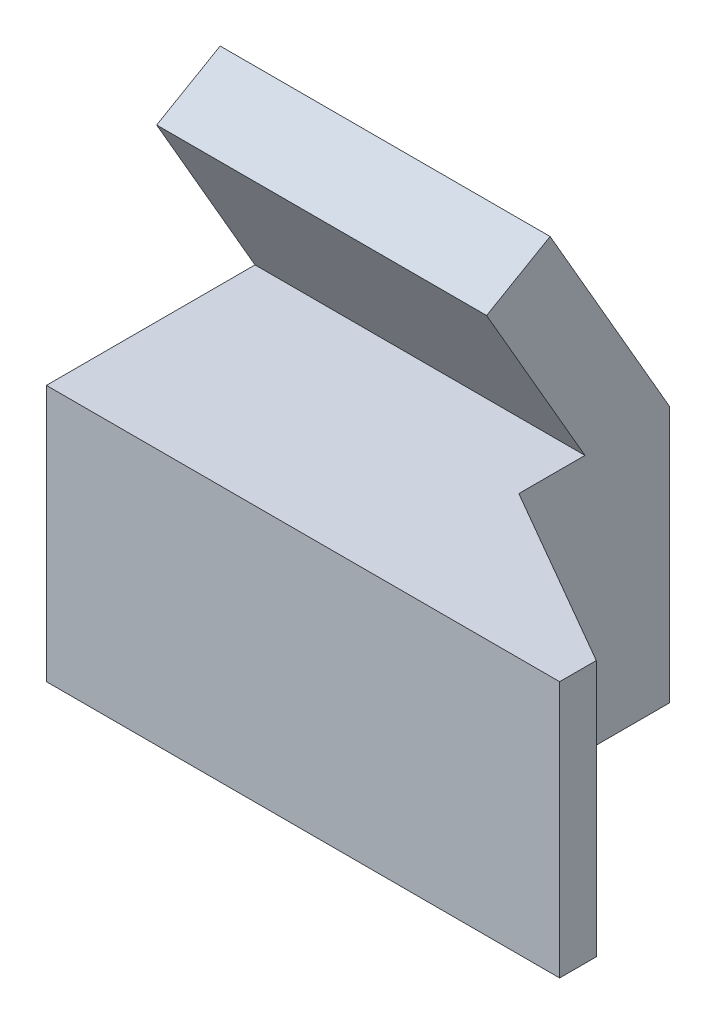
ISO-10303-21;
HEADER;
FILE_DESCRIPTION(('STEP AP214'),'2;1');
FILE_NAME('part.step','',(''),(''),'','','');
FILE_SCHEMA(('AUTOMOTIVE_DESIGN { 1 0 10303 214 1 1 1 1 }'));
ENDSEC;
DATA;
#1=APPLICATION_CONTEXT('core data for automotive mechanical design processes');
#2=APPLICATION_PROTOCOL_DEFINITION('international standard','automotive_design',2000,#1);
#3=PRODUCT_CONTEXT('',#1,'mechanical');
#4=PRODUCT('Part','Part','',(#3));
#5=PRODUCT_RELATED_PRODUCT_CATEGORY('part','',(#4));
#6=PRODUCT_DEFINITION_FORMATION('','',#4);
#7=PRODUCT_DEFINITION_CONTEXT('part definition',#1,'design');
#8=PRODUCT_DEFINITION('design','',#6,#7);
#9=PRODUCT_DEFINITION_SHAPE('','',#8);
#10=(LENGTH_UNIT() NAMED_UNIT(*) SI_UNIT(.MILLI.,.METRE.));
#11=(NAMED_UNIT(*) PLANE_ANGLE_UNIT() SI_UNIT($,.RADIAN.));
#12=(NAMED_UNIT(*) SI_UNIT($,.STERADIAN.) SOLID_ANGLE_UNIT());
#13=UNCERTAINTY_MEASURE_WITH_UNIT(LENGTH_MEASURE(1.E-05),#10,'distance_accuracy_value','');
#14=(GEOMETRIC_REPRESENTATION_CONTEXT(3) GLOBAL_UNCERTAINTY_ASSIGNED_CONTEXT((#13)) GLOBAL_UNIT_ASSIGNED_CONTEXT((#10,
#11,#12)) REPRESENTATION_CONTEXT('',''));
#15=CARTESIAN_POINT('',(0.,0.,0.));
#16=DIRECTION('',(0.,0.,1.));
#17=DIRECTION('',(1.,0.,0.));
#18=AXIS2_PLACEMENT_3D('',#15,#16,#17);
#19=CARTESIAN_POINT('',(0.,44.45,0.));
#20=DIRECTION('',(1.,0.,0.));
#21=DIRECTION('',(0.,0.,-1.));
#22=AXIS2_PLACEMENT_3D('',#19,#20,#21);
#23=PLANE('',#22);
#24=DIRECTION('',(0.,0.,1.));
#25=VECTOR('',#24,1.);
#26=CARTESIAN_POINT('',(0.,0.,0.));
#27=LINE('',#26,#25);
#28=CARTESIAN_POINT('',(0.,0.,-50.8));
#29=VERTEX_POINT('',#28);
#30=CARTESIAN_POINT('',(0.,0.,0.));
#31=VERTEX_POINT('',#30);
#32=EDGE_CURVE('E138',#29,#31,#27,.T.);
#33=ORIENTED_EDGE('',*,*,#32,.T.);
#34=DIRECTION('',(0.,-1.,0.));
#35=VECTOR('',#34,1.);
#36=CARTESIAN_POINT('',(0.,44.45,0.));
#37=LINE('',#36,#35);
#38=CARTESIAN_POINT('',(0.,44.45,0.));
#39=VERTEX_POINT('',#38);
#40=EDGE_CURVE('E11',#39,#31,#37,.T.);
#41=ORIENTED_EDGE('',*,*,#40,.F.);
#42=DIRECTION('',(0.,0.,1.));
#43=VECTOR('',#42,1.);
#44=CARTESIAN_POINT('',(0.,44.45,0.));
#45=LINE('',#44,#43);
#46=CARTESIAN_POINT('',(0.,44.45,-36.1353031625836));
#47=VERTEX_POINT('',#46);
#48=EDGE_CURVE('E95',#47,#39,#45,.T.);
#49=ORIENTED_EDGE('',*,*,#48,.F.);
#50=DIRECTION('',(0.,0.866025403784442,0.499999999999995));
#51=VECTOR('',#50,1.);
#52=CARTESIAN_POINT('',(0.,73.9551837674835,-19.1004773719378));
#53=LINE('',#52,#51);
#54=CARTESIAN_POINT('',(0.,73.9551837674835,-19.1004773719378));
#55=VERTEX_POINT('',#54);
#56=EDGE_CURVE('E194',#47,#55,#53,.T.);
#57=ORIENTED_EDGE('',*,*,#56,.T.);
#58=DIRECTION('',(0.,0.499999999999993,-0.866025403784443));
#59=VECTOR('',#58,1.);
#60=CARTESIAN_POINT('',(0.,80.3051837674834,-30.0990000000002));
#61=LINE('',#60,#59);
#62=CARTESIAN_POINT('',(0.,80.3051837674834,-30.0990000000002));
#63=VERTEX_POINT('',#62);
#64=EDGE_CURVE('E198',#55,#63,#61,.T.);
#65=ORIENTED_EDGE('',*,*,#64,.T.);
#66=DIRECTION('',(0.,-0.866025403784442,-0.499999999999995));
#67=VECTOR('',#66,1.);
#68=CARTESIAN_POINT('',(0.,44.45,-50.8));
#69=LINE('',#68,#67);
#70=CARTESIAN_POINT('',(0.,44.45,-50.8));
#71=VERTEX_POINT('',#70);
#72=EDGE_CURVE('E203',#63,#71,#69,.T.);
#73=ORIENTED_EDGE('',*,*,#72,.T.);
#74=DIRECTION('',(0.,-1.,0.));
#75=VECTOR('',#74,1.);
#76=CARTESIAN_POINT('',(0.,44.45,-50.8));
#77=LINE('',#76,#75);
#78=EDGE_CURVE('E63',#71,#29,#77,.T.);
#79=ORIENTED_EDGE('',*,*,#78,.T.);
#80=EDGE_LOOP('',(#33,#41,#49,#57,#65,#73,#79));
#81=FACE_BOUND('',#80,.T.);
#82=ADVANCED_FACE('F39',(#81),#23,.F.);
#83=CARTESIAN_POINT('',(57.15,44.45,0.));
#84=DIRECTION('',(0.,0.,-1.));
#85=DIRECTION('',(-1.,0.,0.));
#86=AXIS2_PLACEMENT_3D('',#83,#84,#85);
#87=PLANE('',#86);
#88=DIRECTION('',(1.,0.,0.));
#89=VECTOR('',#88,1.);
#90=CARTESIAN_POINT('',(57.15,0.,0.));
#91=LINE('',#90,#89);
#92=CARTESIAN_POINT('',(88.9,0.,0.));
#93=VERTEX_POINT('',#92);
#94=EDGE_CURVE('E142',#31,#93,#91,.T.);
#95=ORIENTED_EDGE('',*,*,#94,.T.);
#96=DIRECTION('',(0.,-1.,0.));
#97=VECTOR('',#96,1.);
#98=CARTESIAN_POINT('',(88.9,44.45,0.));
#99=LINE('',#98,#97);
#100=CARTESIAN_POINT('',(88.9,44.45,0.));
#101=VERTEX_POINT('',#100);
#102=EDGE_CURVE('E47',#101,#93,#99,.T.);
#103=ORIENTED_EDGE('',*,*,#102,.F.);
#104=DIRECTION('',(1.,0.,0.));
#105=VECTOR('',#104,1.);
#106=CARTESIAN_POINT('',(0.,44.45,0.));
#107=LINE('',#106,#105);
#108=EDGE_CURVE('E220',#39,#101,#107,.T.);
#109=ORIENTED_EDGE('',*,*,#108,.F.);
#110=ORIENTED_EDGE('',*,*,#40,.T.);
#111=EDGE_LOOP('',(#95,#103,#109,#110));
#112=FACE_BOUND('',#111,.T.);
#113=ADVANCED_FACE('F224',(#112),#87,.F.);
#114=CARTESIAN_POINT('',(88.9,44.45,0.));
#115=DIRECTION('',(-1.,0.,0.));
#116=DIRECTION('',(0.,0.,1.));
#117=AXIS2_PLACEMENT_3D('',#114,#115,#116);
#118=PLANE('',#117);
#119=DIRECTION('',(0.,0.,-1.));
#120=VECTOR('',#119,1.);
#121=CARTESIAN_POINT('',(88.9,0.,0.));
#122=LINE('',#121,#120);
#123=CARTESIAN_POINT('',(88.9,0.,-6.35));
#124=VERTEX_POINT('',#123);
#125=EDGE_CURVE('E146',#93,#124,#122,.T.);
#126=ORIENTED_EDGE('',*,*,#125,.T.);
#127=DIRECTION('',(0.,-1.,0.));
#128=VECTOR('',#127,1.);
#129=CARTESIAN_POINT('',(88.9,44.45,-6.35));
#130=LINE('',#129,#128);
#131=CARTESIAN_POINT('',(88.9,44.45,-6.35));
#132=VERTEX_POINT('',#131);
#133=EDGE_CURVE('E123',#132,#124,#130,.T.);
#134=ORIENTED_EDGE('',*,*,#133,.F.);
#135=DIRECTION('',(0.,0.,-1.));
#136=VECTOR('',#135,1.);
#137=CARTESIAN_POINT('',(88.9,44.45,0.));
#138=LINE('',#137,#136);
#139=EDGE_CURVE('E109',#101,#132,#138,.T.);
#140=ORIENTED_EDGE('',*,*,#139,.F.);
#141=ORIENTED_EDGE('',*,*,#102,.T.);
#142=EDGE_LOOP('',(#126,#134,#140,#141));
#143=FACE_BOUND('',#142,.T.);
#144=ADVANCED_FACE('F166',(#143),#118,.F.);
#145=CARTESIAN_POINT('',(88.9,44.45,-6.35));
#146=DIRECTION('',(-0.499999999999998,0.,0.86602540378444));
#147=DIRECTION('',(0.86602540378444,0.,0.499999999999998));
#148=AXIS2_PLACEMENT_3D('',#145,#146,#147);
#149=PLANE('',#148);
#150=CARTESIAN_POINT('',(72.4022160579064,22.352,-15.875));
#151=DIRECTION('',(0.499999999999998,0.,-0.86602540378444));
#152=DIRECTION('',(-0.86602540378444,0.,-0.499999999999998));
#153=AXIS2_PLACEMENT_3D('',#150,#151,#152);
#154=CIRCLE('',#153,9.525);
#155=CARTESIAN_POINT('',(64.1533240868596,22.352,-20.6374999999999));
#156=VERTEX_POINT('',#155);
#157=EDGE_CURVE('E208',#156,#156,#154,.T.);
#158=ORIENTED_EDGE('',*,*,#157,.F.);
#159=EDGE_LOOP('',(#158));
#160=FACE_BOUND('',#159,.T.);
#161=DIRECTION('',(-0.86602540378444,0.,-0.499999999999998));
#162=VECTOR('',#161,1.);
#163=CARTESIAN_POINT('',(88.9,0.,-6.35));
#164=LINE('',#163,#162);
#165=CARTESIAN_POINT('',(57.15,0.,-24.6808710467705));
#166=VERTEX_POINT('',#165);
#167=EDGE_CURVE('E119',#124,#166,#164,.T.);
#168=ORIENTED_EDGE('',*,*,#167,.T.);
#169=DIRECTION('',(0.,-1.,0.));
#170=VECTOR('',#169,1.);
#171=CARTESIAN_POINT('',(57.15,44.45,-24.6808710467705));
#172=LINE('',#171,#170);
#173=CARTESIAN_POINT('',(57.15,44.45,-24.6808710467705));
#174=VERTEX_POINT('',#173);
#175=EDGE_CURVE('E116',#174,#166,#172,.T.);
#176=ORIENTED_EDGE('',*,*,#175,.F.);
#177=DIRECTION('',(-0.86602540378444,0.,-0.499999999999998));
#178=VECTOR('',#177,1.);
#179=CARTESIAN_POINT('',(88.9,44.45,-6.35));
#180=LINE('',#179,#178);
#181=EDGE_CURVE('E105',#132,#174,#180,.T.);
#182=ORIENTED_EDGE('',*,*,#181,.F.);
#183=ORIENTED_EDGE('',*,*,#133,.T.);
#184=EDGE_LOOP('',(#168,#176,#182,#183));
#185=FACE_BOUND('',#184,.T.);
#186=ADVANCED_FACE('F117',(#160,#185),#149,.F.);
#187=CARTESIAN_POINT('',(57.15,44.45,-24.6808710467705));
#188=DIRECTION('',(-1.,0.,0.));
#189=DIRECTION('',(0.,0.,1.));
#190=AXIS2_PLACEMENT_3D('',#187,#188,#189);
#191=PLANE('',#190);
#192=DIRECTION('',(0.,0.,-1.));
#193=VECTOR('',#192,1.);
#194=CARTESIAN_POINT('',(57.15,0.,-24.6808710467705));
#195=LINE('',#194,#193);
#196=CARTESIAN_POINT('',(57.15,0.,-50.8));
#197=VERTEX_POINT('',#196);
#198=EDGE_CURVE('E151',#166,#197,#195,.T.);
#199=ORIENTED_EDGE('',*,*,#198,.T.);
#200=DIRECTION('',(0.,-1.,0.));
#201=VECTOR('',#200,1.);
#202=CARTESIAN_POINT('',(57.15,44.45,-50.8));
#203=LINE('',#202,#201);
#204=CARTESIAN_POINT('',(57.15,44.45,-50.8));
#205=VERTEX_POINT('',#204);
#206=EDGE_CURVE('E124',#205,#197,#203,.T.);
#207=ORIENTED_EDGE('',*,*,#206,.F.);
#208=DIRECTION('',(0.,-0.866025403784442,-0.499999999999995));
#209=VECTOR('',#208,1.);
#210=CARTESIAN_POINT('',(57.15,44.45,-50.8));
#211=LINE('',#210,#209);
#212=CARTESIAN_POINT('',(57.15,80.3051837674834,-30.0990000000002));
#213=VERTEX_POINT('',#212);
#214=EDGE_CURVE('E178',#213,#205,#211,.T.);
#215=ORIENTED_EDGE('',*,*,#214,.F.);
#216=DIRECTION('',(0.,0.499999999999993,-0.866025403784443));
#217=VECTOR('',#216,1.);
#218=CARTESIAN_POINT('',(57.15,80.3051837674834,-30.0990000000002));
#219=LINE('',#218,#217);
#220=CARTESIAN_POINT('',(57.15,73.9551837674835,-19.1004773719378));
#221=VERTEX_POINT('',#220);
#222=EDGE_CURVE('E185',#221,#213,#219,.T.);
#223=ORIENTED_EDGE('',*,*,#222,.F.);
#224=DIRECTION('',(0.,0.866025403784442,0.499999999999995));
#225=VECTOR('',#224,1.);
#226=CARTESIAN_POINT('',(57.15,73.9551837674835,-19.1004773719378));
#227=LINE('',#226,#225);
#228=CARTESIAN_POINT('',(57.15,44.45,-36.1353031625836));
#229=VERTEX_POINT('',#228);
#230=EDGE_CURVE('E130',#229,#221,#227,.T.);
#231=ORIENTED_EDGE('',*,*,#230,.F.);
#232=DIRECTION('',(0.,0.,-1.));
#233=VECTOR('',#232,1.);
#234=CARTESIAN_POINT('',(57.15,44.45,-24.6808710467705));
#235=LINE('',#234,#233);
#236=EDGE_CURVE('E54',#174,#229,#235,.T.);
#237=ORIENTED_EDGE('',*,*,#236,.F.);
#238=ORIENTED_EDGE('',*,*,#175,.T.);
#239=EDGE_LOOP('',(#199,#207,#215,#223,#231,#237,#238));
#240=FACE_BOUND('',#239,.T.);
#241=ADVANCED_FACE('F127',(#240),#191,.F.);
#242=CARTESIAN_POINT('',(0.,44.45,-50.8));
#243=DIRECTION('',(0.,0.,1.));
#244=DIRECTION('',(1.,0.,0.));
#245=AXIS2_PLACEMENT_3D('',#242,#243,#244);
#246=PLANE('',#245);
#247=CARTESIAN_POINT('',(41.1479999999998,12.7,-50.8));
#248=DIRECTION('',(0.,0.,-1.));
#249=DIRECTION('',(-1.,0.,0.));
#250=AXIS2_PLACEMENT_3D('',#247,#248,#249);
#251=CIRCLE('',#250,4.7625);
#252=CARTESIAN_POINT('',(36.3854999999998,12.7,-50.8));
#253=VERTEX_POINT('',#252);
#254=EDGE_CURVE('E409',#253,#253,#251,.T.);
#255=ORIENTED_EDGE('',*,*,#254,.F.);
#256=EDGE_LOOP('',(#255));
#257=FACE_BOUND('',#256,.T.);
#258=CARTESIAN_POINT('',(16.002,12.7,-50.8));
#259=DIRECTION('',(0.,0.,-1.));
#260=DIRECTION('',(-1.,0.,0.));
#261=AXIS2_PLACEMENT_3D('',#258,#259,#260);
#262=CIRCLE('',#261,4.7625000000002);
#263=CARTESIAN_POINT('',(11.2394999999998,12.7,-50.8));
#264=VERTEX_POINT('',#263);
#265=EDGE_CURVE('E408',#264,#264,#262,.T.);
#266=ORIENTED_EDGE('',*,*,#265,.F.);
#267=EDGE_LOOP('',(#266));
#268=FACE_BOUND('',#267,.T.);
#269=CARTESIAN_POINT('',(16.002,31.75,-50.8));
#270=DIRECTION('',(0.,0.,-1.));
#271=DIRECTION('',(-1.,0.,0.));
#272=AXIS2_PLACEMENT_3D('',#269,#270,#271);
#273=CIRCLE('',#272,4.7625);
#274=CARTESIAN_POINT('',(11.2395,31.75,-50.8));
#275=VERTEX_POINT('',#274);
#276=EDGE_CURVE('E439',#275,#275,#273,.T.);
#277=ORIENTED_EDGE('',*,*,#276,.F.);
#278=EDGE_LOOP('',(#277));
#279=FACE_BOUND('',#278,.T.);
#280=CARTESIAN_POINT('',(41.148,31.75,-50.8));
#281=DIRECTION('',(0.,0.,-1.));
#282=DIRECTION('',(-1.,0.,0.));
#283=AXIS2_PLACEMENT_3D('',#280,#281,#282);
#284=CIRCLE('',#283,4.7625);
#285=CARTESIAN_POINT('',(36.3855,31.75,-50.8));
#286=VERTEX_POINT('',#285);
#287=EDGE_CURVE('E425',#286,#286,#284,.T.);
#288=ORIENTED_EDGE('',*,*,#287,.F.);
#289=EDGE_LOOP('',(#288));
#290=FACE_BOUND('',#289,.T.);
#291=DIRECTION('',(-1.,0.,0.));
#292=VECTOR('',#291,1.);
#293=CARTESIAN_POINT('',(0.,0.,-50.8));
#294=LINE('',#293,#292);
#295=EDGE_CURVE('E89',#197,#29,#294,.T.);
#296=ORIENTED_EDGE('',*,*,#295,.T.);
#297=ORIENTED_EDGE('',*,*,#78,.F.);
#298=DIRECTION('',(-1.,0.,0.));
#299=VECTOR('',#298,1.);
#300=CARTESIAN_POINT('',(0.,44.45,-50.8));
#301=LINE('',#300,#299);
#302=EDGE_CURVE('E132',#205,#71,#301,.T.);
#303=ORIENTED_EDGE('',*,*,#302,.F.);
#304=ORIENTED_EDGE('',*,*,#206,.T.);
#305=EDGE_LOOP('',(#296,#297,#303,#304));
#306=FACE_BOUND('',#305,.T.);
#307=ADVANCED_FACE('F172',(#257,#268,#279,#290,#306),#246,.F.);
#308=CARTESIAN_POINT('',(0.,44.45,0.));
#309=DIRECTION('',(0.,-1.,0.));
#310=DIRECTION('',(0.,0.,-1.));
#311=AXIS2_PLACEMENT_3D('',#308,#309,#310);
#312=PLANE('',#311);
#313=ORIENTED_EDGE('',*,*,#236,.T.);
#314=DIRECTION('',(-1.,0.,0.));
#315=VECTOR('',#314,1.);
#316=CARTESIAN_POINT('',(57.15,44.45,-36.1353031625836));
#317=LINE('',#316,#315);
#318=EDGE_CURVE('E184',#229,#47,#317,.T.);
#319=ORIENTED_EDGE('',*,*,#318,.T.);
#320=ORIENTED_EDGE('',*,*,#48,.T.);
#321=ORIENTED_EDGE('',*,*,#108,.T.);
#322=ORIENTED_EDGE('',*,*,#139,.T.);
#323=ORIENTED_EDGE('',*,*,#181,.T.);
#324=EDGE_LOOP('',(#313,#319,#320,#321,#322,#323));
#325=FACE_BOUND('',#324,.T.);
#326=ADVANCED_FACE('F107',(#325),#312,.F.);
#327=CARTESIAN_POINT('',(0.,0.,0.));
#328=DIRECTION('',(0.,-1.,0.));
#329=DIRECTION('',(0.,0.,-1.));
#330=AXIS2_PLACEMENT_3D('',#327,#328,#329);
#331=PLANE('',#330);
#332=ORIENTED_EDGE('',*,*,#198,.F.);
#333=ORIENTED_EDGE('',*,*,#167,.F.);
#334=ORIENTED_EDGE('',*,*,#125,.F.);
#335=ORIENTED_EDGE('',*,*,#94,.F.);
#336=ORIENTED_EDGE('',*,*,#32,.F.);
#337=ORIENTED_EDGE('',*,*,#295,.F.);
#338=EDGE_LOOP('',(#332,#333,#334,#335,#336,#337));
#339=FACE_BOUND('',#338,.T.);
#340=ADVANCED_FACE('F169',(#339),#331,.T.);
#341=CARTESIAN_POINT('',(69.2272160579064,22.352,-10.3757386859688));
#342=DIRECTION('',(0.499999999999998,0.,-0.86602540378444));
#343=DIRECTION('',(-0.86602540378444,0.,-0.499999999999998));
#344=AXIS2_PLACEMENT_3D('',#341,#342,#343);
#345=CYLINDRICAL_SURFACE('',#344,9.525);
#346=CARTESIAN_POINT('',(69.2272160579064,22.352,-10.3757386859688));
#347=DIRECTION('',(0.499999999999998,0.,-0.86602540378444));
#348=DIRECTION('',(-0.86602540378444,0.,-0.499999999999998));
#349=AXIS2_PLACEMENT_3D('',#346,#347,#348);
#350=CIRCLE('',#349,9.525);
#351=CARTESIAN_POINT('',(60.9783240868597,22.352,-15.1382386859688));
#352=VERTEX_POINT('',#351);
#353=EDGE_CURVE('E143',#352,#352,#350,.T.);
#354=ORIENTED_EDGE('',*,*,#353,.F.);
#355=EDGE_LOOP('',(#354));
#356=FACE_BOUND('',#355,.T.);
#357=ORIENTED_EDGE('',*,*,#157,.T.);
#358=EDGE_LOOP('',(#357));
#359=FACE_BOUND('',#358,.T.);
#360=ADVANCED_FACE('F269',(#356,#359),#345,.F.);
#361=CARTESIAN_POINT('',(69.2272160579064,22.352,-10.3757386859688));
#362=DIRECTION('',(0.499999999999998,0.,-0.86602540378444));
#363=DIRECTION('',(-0.86602540378444,0.,-0.499999999999998));
#364=AXIS2_PLACEMENT_3D('',#361,#362,#363);
#365=PLANE('',#364);
#366=ORIENTED_EDGE('',*,*,#353,.T.);
#367=EDGE_LOOP('',(#366));
#368=FACE_BOUND('',#367,.T.);
#369=ADVANCED_FACE('F247',(#368),#365,.T.);
#370=CARTESIAN_POINT('',(57.15,44.45,-50.8));
#371=DIRECTION('',(0.,0.499999999999995,-0.866025403784442));
#372=DIRECTION('',(0.,0.866025403784442,0.499999999999995));
#373=AXIS2_PLACEMENT_3D('',#370,#371,#372);
#374=PLANE('',#373);
#375=CARTESIAN_POINT('',(28.702,63.8073998253899,-39.6240000000001));
#376=DIRECTION('',(0.,0.499999999999995,-0.866025403784442));
#377=DIRECTION('',(0.,0.866025403784442,0.499999999999995));
#378=AXIS2_PLACEMENT_3D('',#375,#376,#377);
#379=CIRCLE('',#378,9.525);
#380=CARTESIAN_POINT('',(28.702,72.0562917964367,-34.8615000000002));
#381=VERTEX_POINT('',#380);
#382=EDGE_CURVE('E424',#381,#381,#379,.T.);
#383=ORIENTED_EDGE('',*,*,#382,.F.);
#384=EDGE_LOOP('',(#383));
#385=FACE_BOUND('',#384,.T.);
#386=ORIENTED_EDGE('',*,*,#72,.F.);
#387=DIRECTION('',(-1.,0.,0.));
#388=VECTOR('',#387,1.);
#389=CARTESIAN_POINT('',(57.15,80.3051837674834,-30.0990000000002));
#390=LINE('',#389,#388);
#391=EDGE_CURVE('E181',#213,#63,#390,.T.);
#392=ORIENTED_EDGE('',*,*,#391,.F.);
#393=ORIENTED_EDGE('',*,*,#214,.T.);
#394=ORIENTED_EDGE('',*,*,#302,.T.);
#395=EDGE_LOOP('',(#386,#392,#393,#394));
#396=FACE_BOUND('',#395,.T.);
#397=ADVANCED_FACE('F179',(#385,#396),#374,.T.);
#398=CARTESIAN_POINT('',(57.15,80.3051837674834,-30.0990000000002));
#399=DIRECTION('',(0.,0.866025403784443,0.499999999999993));
#400=DIRECTION('',(0.,-0.499999999999993,0.866025403784443));
#401=AXIS2_PLACEMENT_3D('',#398,#399,#400);
#402=PLANE('',#401);
#403=ORIENTED_EDGE('',*,*,#64,.F.);
#404=DIRECTION('',(-1.,0.,0.));
#405=VECTOR('',#404,1.);
#406=CARTESIAN_POINT('',(57.15,73.9551837674835,-19.1004773719378));
#407=LINE('',#406,#405);
#408=EDGE_CURVE('E189',#221,#55,#407,.T.);
#409=ORIENTED_EDGE('',*,*,#408,.F.);
#410=ORIENTED_EDGE('',*,*,#222,.T.);
#411=ORIENTED_EDGE('',*,*,#391,.T.);
#412=EDGE_LOOP('',(#403,#409,#410,#411));
#413=FACE_BOUND('',#412,.T.);
#414=ADVANCED_FACE('F238',(#413),#402,.T.);
#415=CARTESIAN_POINT('',(57.15,73.9551837674835,-19.1004773719378));
#416=DIRECTION('',(0.,-0.499999999999995,0.866025403784442));
#417=DIRECTION('',(0.,-0.866025403784442,-0.499999999999995));
#418=AXIS2_PLACEMENT_3D('',#415,#416,#417);
#419=PLANE('',#418);
#420=ORIENTED_EDGE('',*,*,#56,.F.);
#421=ORIENTED_EDGE('',*,*,#318,.F.);
#422=ORIENTED_EDGE('',*,*,#230,.T.);
#423=ORIENTED_EDGE('',*,*,#408,.T.);
#424=EDGE_LOOP('',(#420,#421,#422,#423));
#425=FACE_BOUND('',#424,.T.);
#426=ADVANCED_FACE('F237',(#425),#419,.T.);
#427=CARTESIAN_POINT('',(28.702,60.6323998253899,-34.1247386859689));
#428=DIRECTION('',(0.,0.499999999999995,-0.866025403784442));
#429=DIRECTION('',(0.,0.866025403784442,0.499999999999995));
#430=AXIS2_PLACEMENT_3D('',#427,#428,#429);
#431=CYLINDRICAL_SURFACE('',#430,9.525);
#432=CARTESIAN_POINT('',(28.702,60.6323998253899,-34.1247386859689));
#433=DIRECTION('',(0.,0.499999999999995,-0.866025403784442));
#434=DIRECTION('',(0.,0.866025403784442,0.499999999999995));
#435=AXIS2_PLACEMENT_3D('',#432,#433,#434);
#436=CIRCLE('',#435,9.525);
#437=CARTESIAN_POINT('',(28.702,68.8812917964367,-29.362238685969));
#438=VERTEX_POINT('',#437);
#439=EDGE_CURVE('E199',#438,#438,#436,.T.);
#440=ORIENTED_EDGE('',*,*,#439,.F.);
#441=EDGE_LOOP('',(#440));
#442=FACE_BOUND('',#441,.T.);
#443=ORIENTED_EDGE('',*,*,#382,.T.);
#444=EDGE_LOOP('',(#443));
#445=FACE_BOUND('',#444,.T.);
#446=ADVANCED_FACE('F245',(#442,#445),#431,.F.);
#447=CARTESIAN_POINT('',(28.702,60.6323998253899,-34.1247386859689));
#448=DIRECTION('',(0.,0.499999999999995,-0.866025403784442));
#449=DIRECTION('',(0.,0.866025403784442,0.499999999999995));
#450=AXIS2_PLACEMENT_3D('',#447,#448,#449);
#451=PLANE('',#450);
#452=ORIENTED_EDGE('',*,*,#439,.T.);
#453=EDGE_LOOP('',(#452));
#454=FACE_BOUND('',#453,.T.);
#455=ADVANCED_FACE('F302',(#454),#451,.T.);
#456=CARTESIAN_POINT('',(41.148,31.75,-38.1));
#457=DIRECTION('',(0.,0.,-1.));
#458=DIRECTION('',(-1.,0.,0.));
#459=AXIS2_PLACEMENT_3D('',#456,#457,#458);
#460=CYLINDRICAL_SURFACE('',#459,4.7625);
#461=CARTESIAN_POINT('',(41.148,31.75,-38.1));
#462=DIRECTION('',(0.,0.,-1.));
#463=DIRECTION('',(-1.,0.,0.));
#464=AXIS2_PLACEMENT_3D('',#461,#462,#463);
#465=CIRCLE('',#464,4.7625);
#466=CARTESIAN_POINT('',(36.3855,31.75,-38.1));
#467=VERTEX_POINT('',#466);
#468=EDGE_CURVE('E420',#467,#467,#465,.T.);
#469=ORIENTED_EDGE('',*,*,#468,.F.);
#470=EDGE_LOOP('',(#469));
#471=FACE_BOUND('',#470,.T.);
#472=ORIENTED_EDGE('',*,*,#287,.T.);
#473=EDGE_LOOP('',(#472));
#474=FACE_BOUND('',#473,.T.);
#475=ADVANCED_FACE('F312',(#471,#474),#460,.F.);
#476=CARTESIAN_POINT('',(41.148,31.75,-38.1));
#477=DIRECTION('',(0.,0.,-1.));
#478=DIRECTION('',(-1.,0.,0.));
#479=AXIS2_PLACEMENT_3D('',#476,#477,#478);
#480=PLANE('',#479);
#481=ORIENTED_EDGE('',*,*,#468,.T.);
#482=EDGE_LOOP('',(#481));
#483=FACE_BOUND('',#482,.T.);
#484=ADVANCED_FACE('F330',(#483),#480,.T.);
#485=CARTESIAN_POINT('',(16.002,31.75,-38.1));
#486=DIRECTION('',(0.,0.,-1.));
#487=DIRECTION('',(-1.,0.,0.));
#488=AXIS2_PLACEMENT_3D('',#485,#486,#487);
#489=CYLINDRICAL_SURFACE('',#488,4.7625);
#490=CARTESIAN_POINT('',(16.002,31.75,-38.1));
#491=DIRECTION('',(0.,0.,-1.));
#492=DIRECTION('',(-1.,0.,0.));
#493=AXIS2_PLACEMENT_3D('',#490,#491,#492);
#494=CIRCLE('',#493,4.7625);
#495=CARTESIAN_POINT('',(11.2395,31.75,-38.1));
#496=VERTEX_POINT('',#495);
#497=EDGE_CURVE('E429',#496,#496,#494,.T.);
#498=ORIENTED_EDGE('',*,*,#497,.F.);
#499=EDGE_LOOP('',(#498));
#500=FACE_BOUND('',#499,.T.);
#501=ORIENTED_EDGE('',*,*,#276,.T.);
#502=EDGE_LOOP('',(#501));
#503=FACE_BOUND('',#502,.T.);
#504=ADVANCED_FACE('F340',(#500,#503),#489,.F.);
#505=CARTESIAN_POINT('',(16.002,31.75,-38.1));
#506=DIRECTION('',(0.,0.,-1.));
#507=DIRECTION('',(-1.,0.,0.));
#508=AXIS2_PLACEMENT_3D('',#505,#506,#507);
#509=PLANE('',#508);
#510=ORIENTED_EDGE('',*,*,#497,.T.);
#511=EDGE_LOOP('',(#510));
#512=FACE_BOUND('',#511,.T.);
#513=ADVANCED_FACE('F350',(#512),#509,.T.);
#514=CARTESIAN_POINT('',(16.002,12.7,-38.1));
#515=DIRECTION('',(0.,0.,-1.));
#516=DIRECTION('',(-1.,0.,0.));
#517=AXIS2_PLACEMENT_3D('',#514,#515,#516);
#518=CYLINDRICAL_SURFACE('',#517,4.7625000000002);
#519=CARTESIAN_POINT('',(16.002,12.7,-38.1));
#520=DIRECTION('',(0.,0.,-1.));
#521=DIRECTION('',(-1.,0.,0.));
#522=AXIS2_PLACEMENT_3D('',#519,#520,#521);
#523=CIRCLE('',#522,4.7625000000002);
#524=CARTESIAN_POINT('',(11.2394999999998,12.7,-38.1));
#525=VERTEX_POINT('',#524);
#526=EDGE_CURVE('E414',#525,#525,#523,.T.);
#527=ORIENTED_EDGE('',*,*,#526,.F.);
#528=EDGE_LOOP('',(#527));
#529=FACE_BOUND('',#528,.T.);
#530=ORIENTED_EDGE('',*,*,#265,.T.);
#531=EDGE_LOOP('',(#530));
#532=FACE_BOUND('',#531,.T.);
#533=ADVANCED_FACE('F360',(#529,#532),#518,.F.);
#534=CARTESIAN_POINT('',(16.002,12.7,-38.1));
#535=DIRECTION('',(0.,0.,-1.));
#536=DIRECTION('',(-1.,0.,0.));
#537=AXIS2_PLACEMENT_3D('',#534,#535,#536);
#538=PLANE('',#537);
#539=ORIENTED_EDGE('',*,*,#526,.T.);
#540=EDGE_LOOP('',(#539));
#541=FACE_BOUND('',#540,.T.);
#542=ADVANCED_FACE('F370',(#541),#538,.T.);
#543=CARTESIAN_POINT('',(41.1479999999998,12.7,-38.1));
#544=DIRECTION('',(0.,0.,-1.));
#545=DIRECTION('',(-1.,0.,0.));
#546=AXIS2_PLACEMENT_3D('',#543,#544,#545);
#547=CYLINDRICAL_SURFACE('',#546,4.7625);
#548=CARTESIAN_POINT('',(41.1479999999998,12.7,-38.1));
#549=DIRECTION('',(0.,0.,-1.));
#550=DIRECTION('',(-1.,0.,0.));
#551=AXIS2_PLACEMENT_3D('',#548,#549,#550);
#552=CIRCLE('',#551,4.7625);
#553=CARTESIAN_POINT('',(36.3854999999998,12.7,-38.1));
#554=VERTEX_POINT('',#553);
#555=EDGE_CURVE('E406',#554,#554,#552,.T.);
#556=ORIENTED_EDGE('',*,*,#555,.F.);
#557=EDGE_LOOP('',(#556));
#558=FACE_BOUND('',#557,.T.);
#559=ORIENTED_EDGE('',*,*,#254,.T.);
#560=EDGE_LOOP('',(#559));
#561=FACE_BOUND('',#560,.T.);
#562=ADVANCED_FACE('F380',(#558,#561),#547,.F.);
#563=CARTESIAN_POINT('',(41.1479999999998,12.7,-38.1));
#564=DIRECTION('',(0.,0.,-1.));
#565=DIRECTION('',(-1.,0.,0.));
#566=AXIS2_PLACEMENT_3D('',#563,#564,#565);
#567=PLANE('',#566);
#568=ORIENTED_EDGE('',*,*,#555,.T.);
#569=EDGE_LOOP('',(#568));
#570=FACE_BOUND('',#569,.T.);
#571=ADVANCED_FACE('F390',(#570),#567,.T.);
#572=CLOSED_SHELL('',(#82,#113,#144,#186,#241,#307,#326,#340,#360,#369,#397,#414,#426,#446,#455,
#475,#484,#504,#513,#533,#542,#562,#571));
#573=MANIFOLD_SOLID_BREP('B2',#572);
#574=ADVANCED_BREP_SHAPE_REPRESENTATION('',(#18,#573),#14);
#575=SHAPE_DEFINITION_REPRESENTATION(#9,#574);
ENDSEC;
END-ISO-10303-21;
